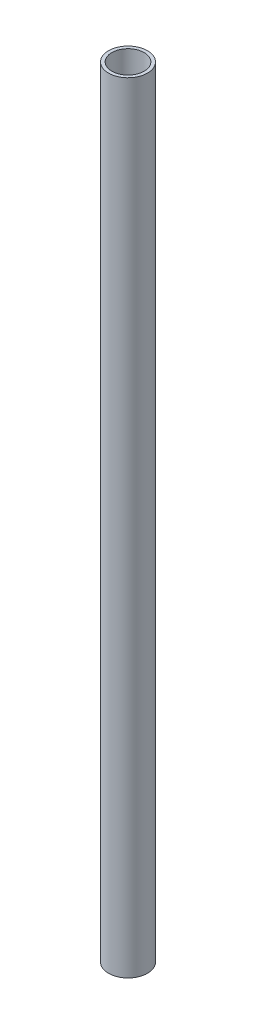
ISO-10303-21;
HEADER;
FILE_DESCRIPTION(('STEP AP214'),'2;1');
FILE_NAME('part.step','',(''),(''),'','','');
FILE_SCHEMA(('AUTOMOTIVE_DESIGN { 1 0 10303 214 1 1 1 1 }'));
ENDSEC;
DATA;
#1=APPLICATION_CONTEXT('core data for automotive mechanical design processes');
#2=APPLICATION_PROTOCOL_DEFINITION('international standard','automotive_design',2000,#1);
#3=PRODUCT_CONTEXT('',#1,'mechanical');
#4=PRODUCT('Part','Part','',(#3));
#5=PRODUCT_RELATED_PRODUCT_CATEGORY('part','',(#4));
#6=PRODUCT_DEFINITION_FORMATION('','',#4);
#7=PRODUCT_DEFINITION_CONTEXT('part definition',#1,'design');
#8=PRODUCT_DEFINITION('design','',#6,#7);
#9=PRODUCT_DEFINITION_SHAPE('','',#8);
#10=(LENGTH_UNIT() NAMED_UNIT(*) SI_UNIT(.MILLI.,.METRE.));
#11=(NAMED_UNIT(*) PLANE_ANGLE_UNIT() SI_UNIT($,.RADIAN.));
#12=(NAMED_UNIT(*) SI_UNIT($,.STERADIAN.) SOLID_ANGLE_UNIT());
#13=UNCERTAINTY_MEASURE_WITH_UNIT(LENGTH_MEASURE(1.E-05),#10,'distance_accuracy_value','');
#14=(GEOMETRIC_REPRESENTATION_CONTEXT(3) GLOBAL_UNCERTAINTY_ASSIGNED_CONTEXT((#13)) GLOBAL_UNIT_ASSIGNED_CONTEXT((#10,
#11,#12)) REPRESENTATION_CONTEXT('',''));
#15=CARTESIAN_POINT('',(0.,0.,0.));
#16=DIRECTION('',(0.,0.,1.));
#17=DIRECTION('',(1.,0.,0.));
#18=AXIS2_PLACEMENT_3D('',#15,#16,#17);
#19=CARTESIAN_POINT('',(0.,844.55,0.));
#20=DIRECTION('',(0.,1.,0.));
#21=DIRECTION('',(0.,0.,1.));
#22=AXIS2_PLACEMENT_3D('',#19,#20,#21);
#23=PLANE('',#22);
#24=CARTESIAN_POINT('',(0.,844.55,0.));
#25=DIRECTION('',(0.,1.,0.));
#26=DIRECTION('',(0.,0.,1.));
#27=AXIS2_PLACEMENT_3D('',#24,#25,#26);
#28=CIRCLE('',#27,21.082);
#29=CARTESIAN_POINT('',(0.,844.55,21.082));
#30=VERTEX_POINT('',#29);
#31=EDGE_CURVE('E12',#30,#30,#28,.T.);
#32=ORIENTED_EDGE('',*,*,#31,.T.);
#33=EDGE_LOOP('',(#32));
#34=FACE_BOUND('',#33,.T.);
#35=CARTESIAN_POINT('',(0.,844.55,0.));
#36=DIRECTION('',(0.,1.,0.));
#37=DIRECTION('',(0.,0.,1.));
#38=AXIS2_PLACEMENT_3D('',#35,#36,#37);
#39=CIRCLE('',#38,17.526);
#40=CARTESIAN_POINT('',(0.,844.55,17.526));
#41=VERTEX_POINT('',#40);
#42=EDGE_CURVE('E53',#41,#41,#39,.T.);
#43=ORIENTED_EDGE('',*,*,#42,.F.);
#44=EDGE_LOOP('',(#43));
#45=FACE_BOUND('',#44,.T.);
#46=ADVANCED_FACE('F42',(#34,#45),#23,.T.);
#47=CARTESIAN_POINT('',(0.,0.,0.));
#48=DIRECTION('',(0.,1.,0.));
#49=DIRECTION('',(0.,0.,1.));
#50=AXIS2_PLACEMENT_3D('',#47,#48,#49);
#51=PLANE('',#50);
#52=CARTESIAN_POINT('',(0.,0.,0.));
#53=DIRECTION('',(0.,1.,0.));
#54=DIRECTION('',(0.,0.,1.));
#55=AXIS2_PLACEMENT_3D('',#52,#53,#54);
#56=CIRCLE('',#55,21.082);
#57=CARTESIAN_POINT('',(0.,0.,21.082));
#58=VERTEX_POINT('',#57);
#59=EDGE_CURVE('E46',#58,#58,#56,.T.);
#60=ORIENTED_EDGE('',*,*,#59,.F.);
#61=EDGE_LOOP('',(#60));
#62=FACE_BOUND('',#61,.T.);
#63=CARTESIAN_POINT('',(0.,0.,0.));
#64=DIRECTION('',(0.,1.,0.));
#65=DIRECTION('',(0.,0.,1.));
#66=AXIS2_PLACEMENT_3D('',#63,#64,#65);
#67=CIRCLE('',#66,17.526);
#68=CARTESIAN_POINT('',(0.,0.,17.526));
#69=VERTEX_POINT('',#68);
#70=EDGE_CURVE('E55',#69,#69,#67,.T.);
#71=ORIENTED_EDGE('',*,*,#70,.T.);
#72=EDGE_LOOP('',(#71));
#73=FACE_BOUND('',#72,.T.);
#74=ADVANCED_FACE('F65',(#62,#73),#51,.F.);
#75=CARTESIAN_POINT('',(0.,844.55,0.));
#76=DIRECTION('',(0.,-1.,0.));
#77=DIRECTION('',(0.,0.,-1.));
#78=AXIS2_PLACEMENT_3D('',#75,#76,#77);
#79=CYLINDRICAL_SURFACE('',#78,21.082);
#80=ORIENTED_EDGE('',*,*,#31,.F.);
#81=EDGE_LOOP('',(#80));
#82=FACE_BOUND('',#81,.T.);
#83=ORIENTED_EDGE('',*,*,#59,.T.);
#84=EDGE_LOOP('',(#83));
#85=FACE_BOUND('',#84,.T.);
#86=ADVANCED_FACE('F44',(#82,#85),#79,.T.);
#87=CARTESIAN_POINT('',(0.,844.55,0.));
#88=DIRECTION('',(0.,-1.,0.));
#89=DIRECTION('',(0.,0.,-1.));
#90=AXIS2_PLACEMENT_3D('',#87,#88,#89);
#91=CYLINDRICAL_SURFACE('',#90,17.526);
#92=ORIENTED_EDGE('',*,*,#42,.T.);
#93=EDGE_LOOP('',(#92));
#94=FACE_BOUND('',#93,.T.);
#95=ORIENTED_EDGE('',*,*,#70,.F.);
#96=EDGE_LOOP('',(#95));
#97=FACE_BOUND('',#96,.T.);
#98=ADVANCED_FACE('F61',(#94,#97),#91,.F.);
#99=CLOSED_SHELL('',(#46,#74,#86,#98));
#100=MANIFOLD_SOLID_BREP('B2',#99);
#101=ADVANCED_BREP_SHAPE_REPRESENTATION('',(#18,#100),#14);
#102=SHAPE_DEFINITION_REPRESENTATION(#9,#101);
ENDSEC;
END-ISO-10303-21;
